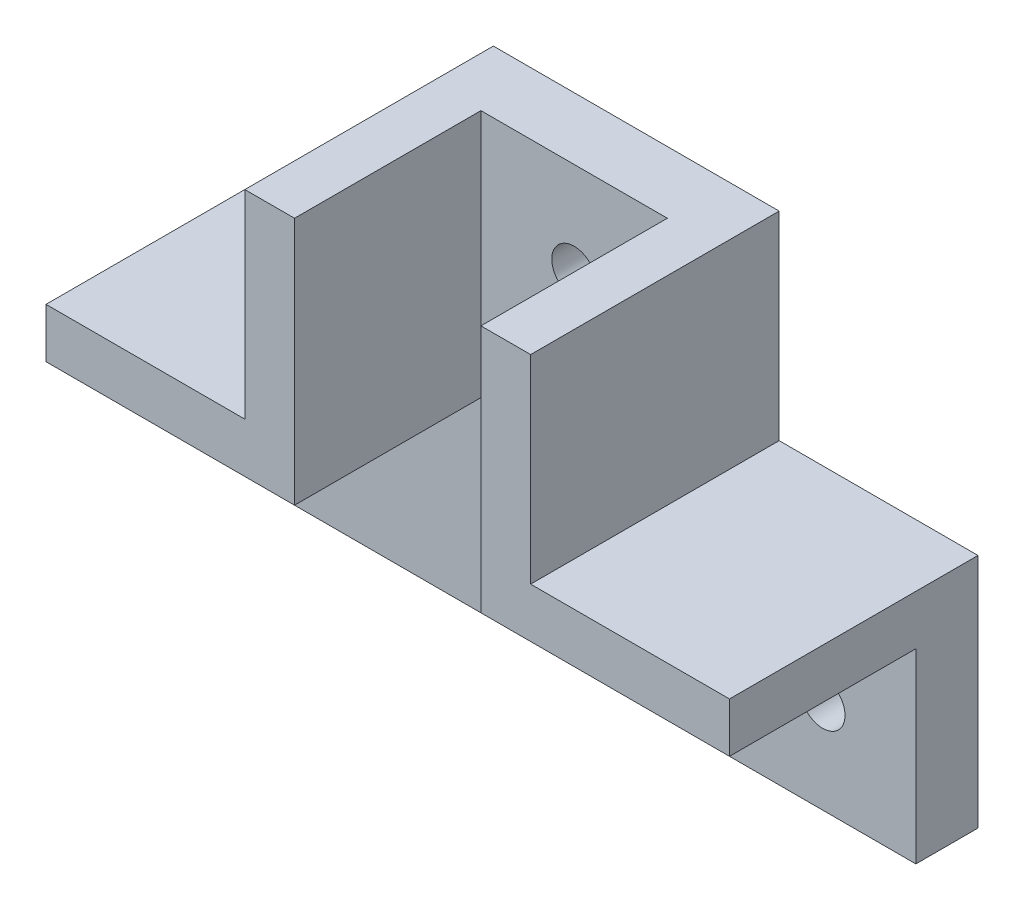
ISO-10303-21;
HEADER;
FILE_DESCRIPTION(('STEP AP214'),'2;1');
FILE_NAME('part.step','',(''),(''),'','','');
FILE_SCHEMA(('AUTOMOTIVE_DESIGN { 1 0 10303 214 1 1 1 1 }'));
ENDSEC;
DATA;
#1=APPLICATION_CONTEXT('core data for automotive mechanical design processes');
#2=APPLICATION_PROTOCOL_DEFINITION('international standard','automotive_design',2000,#1);
#3=PRODUCT_CONTEXT('',#1,'mechanical');
#4=PRODUCT('Part','Part','',(#3));
#5=PRODUCT_RELATED_PRODUCT_CATEGORY('part','',(#4));
#6=PRODUCT_DEFINITION_FORMATION('','',#4);
#7=PRODUCT_DEFINITION_CONTEXT('part definition',#1,'design');
#8=PRODUCT_DEFINITION('design','',#6,#7);
#9=PRODUCT_DEFINITION_SHAPE('','',#8);
#10=(LENGTH_UNIT() NAMED_UNIT(*) SI_UNIT(.MILLI.,.METRE.));
#11=(NAMED_UNIT(*) PLANE_ANGLE_UNIT() SI_UNIT($,.RADIAN.));
#12=(NAMED_UNIT(*) SI_UNIT($,.STERADIAN.) SOLID_ANGLE_UNIT());
#13=UNCERTAINTY_MEASURE_WITH_UNIT(LENGTH_MEASURE(1.E-05),#10,'distance_accuracy_value','');
#14=(GEOMETRIC_REPRESENTATION_CONTEXT(3) GLOBAL_UNCERTAINTY_ASSIGNED_CONTEXT((#13)) GLOBAL_UNIT_ASSIGNED_CONTEXT((#10,
#11,#12)) REPRESENTATION_CONTEXT('',''));
#15=CARTESIAN_POINT('',(0.,0.,0.));
#16=DIRECTION('',(0.,0.,1.));
#17=DIRECTION('',(1.,0.,0.));
#18=AXIS2_PLACEMENT_3D('',#15,#16,#17);
#19=CARTESIAN_POINT('',(-20.6862745098039,-4.26470588235294,5.));
#20=DIRECTION('',(1.,0.,0.));
#21=DIRECTION('',(0.,1.,0.));
#22=AXIS2_PLACEMENT_3D('',#19,#20,#21);
#23=PLANE('',#22);
#24=DIRECTION('',(0.,-1.,0.));
#25=VECTOR('',#24,1.);
#26=CARTESIAN_POINT('',(-20.6862745098039,-4.26470588235294,0.));
#27=LINE('',#26,#25);
#28=CARTESIAN_POINT('',(-20.6862745098039,-0.264705882352941,0.));
#29=VERTEX_POINT('',#28);
#30=CARTESIAN_POINT('',(-20.6862745098039,-19.2647058823529,0.));
#31=VERTEX_POINT('',#30);
#32=EDGE_CURVE('E150',#29,#31,#27,.T.);
#33=ORIENTED_EDGE('',*,*,#32,.T.);
#34=DIRECTION('',(0.,0.,-1.));
#35=VECTOR('',#34,1.);
#36=CARTESIAN_POINT('',(-20.6862745098039,-19.2647058823529,5.));
#37=LINE('',#36,#35);
#38=CARTESIAN_POINT('',(-20.6862745098039,-19.2647058823529,5.));
#39=VERTEX_POINT('',#38);
#40=EDGE_CURVE('E11',#39,#31,#37,.T.);
#41=ORIENTED_EDGE('',*,*,#40,.F.);
#42=DIRECTION('',(0.,-1.,0.));
#43=VECTOR('',#42,1.);
#44=CARTESIAN_POINT('',(-20.6862745098039,-4.26470588235294,5.));
#45=LINE('',#44,#43);
#46=CARTESIAN_POINT('',(-20.6862745098039,-4.26470588235294,5.));
#47=VERTEX_POINT('',#46);
#48=EDGE_CURVE('E139',#47,#39,#45,.T.);
#49=ORIENTED_EDGE('',*,*,#48,.F.);
#50=DIRECTION('',(0.,0.,-1.));
#51=VECTOR('',#50,1.);
#52=CARTESIAN_POINT('',(-20.6862745098039,-4.26470588235294,20.));
#53=LINE('',#52,#51);
#54=CARTESIAN_POINT('',(-20.6862745098039,-4.26470588235294,20.));
#55=VERTEX_POINT('',#54);
#56=EDGE_CURVE('E68',#55,#47,#53,.T.);
#57=ORIENTED_EDGE('',*,*,#56,.F.);
#58=DIRECTION('',(0.,1.,0.));
#59=VECTOR('',#58,1.);
#60=CARTESIAN_POINT('',(-20.6862745098039,-4.26470588235294,20.));
#61=LINE('',#60,#59);
#62=CARTESIAN_POINT('',(-20.6862745098039,-0.264705882352941,20.));
#63=VERTEX_POINT('',#62);
#64=EDGE_CURVE('E209',#55,#63,#61,.T.);
#65=ORIENTED_EDGE('',*,*,#64,.T.);
#66=DIRECTION('',(0.,0.,-1.));
#67=VECTOR('',#66,1.);
#68=CARTESIAN_POINT('',(-20.6862745098039,-0.264705882352941,20.));
#69=LINE('',#68,#67);
#70=EDGE_CURVE('E135',#63,#29,#69,.T.);
#71=ORIENTED_EDGE('',*,*,#70,.T.);
#72=EDGE_LOOP('',(#33,#41,#49,#57,#65,#71));
#73=FACE_BOUND('',#72,.T.);
#74=ADVANCED_FACE('F32',(#73),#23,.F.);
#75=CARTESIAN_POINT('',(-20.6862745098039,-19.2647058823529,5.));
#76=DIRECTION('',(0.,1.,0.));
#77=DIRECTION('',(0.,0.,1.));
#78=AXIS2_PLACEMENT_3D('',#75,#76,#77);
#79=PLANE('',#78);
#80=DIRECTION('',(1.,0.,0.));
#81=VECTOR('',#80,1.);
#82=CARTESIAN_POINT('',(-20.6862745098039,-19.2647058823529,0.));
#83=LINE('',#82,#81);
#84=CARTESIAN_POINT('',(34.3137254901961,-19.2647058823529,0.));
#85=VERTEX_POINT('',#84);
#86=EDGE_CURVE('E60',#31,#85,#83,.T.);
#87=ORIENTED_EDGE('',*,*,#86,.T.);
#88=DIRECTION('',(0.,0.,-1.));
#89=VECTOR('',#88,1.);
#90=CARTESIAN_POINT('',(34.3137254901961,-19.2647058823529,5.));
#91=LINE('',#90,#89);
#92=CARTESIAN_POINT('',(34.3137254901961,-19.2647058823529,5.));
#93=VERTEX_POINT('',#92);
#94=EDGE_CURVE('E40',#93,#85,#91,.T.);
#95=ORIENTED_EDGE('',*,*,#94,.F.);
#96=DIRECTION('',(1.,0.,0.));
#97=VECTOR('',#96,1.);
#98=CARTESIAN_POINT('',(-20.6862745098039,-19.2647058823529,5.));
#99=LINE('',#98,#97);
#100=EDGE_CURVE('E141',#39,#93,#99,.T.);
#101=ORIENTED_EDGE('',*,*,#100,.F.);
#102=ORIENTED_EDGE('',*,*,#40,.T.);
#103=EDGE_LOOP('',(#87,#95,#101,#102));
#104=FACE_BOUND('',#103,.T.);
#105=ADVANCED_FACE('F244',(#104),#79,.F.);
#106=CARTESIAN_POINT('',(34.3137254901961,-4.26470588235294,5.));
#107=DIRECTION('',(-1.,0.,0.));
#108=DIRECTION('',(0.,0.,1.));
#109=AXIS2_PLACEMENT_3D('',#106,#107,#108);
#110=PLANE('',#109);
#111=DIRECTION('',(0.,1.,0.));
#112=VECTOR('',#111,1.);
#113=CARTESIAN_POINT('',(34.3137254901961,-4.26470588235294,0.));
#114=LINE('',#113,#112);
#115=CARTESIAN_POINT('',(34.3137254901961,-0.264705882352946,0.));
#116=VERTEX_POINT('',#115);
#117=EDGE_CURVE('E154',#85,#116,#114,.T.);
#118=ORIENTED_EDGE('',*,*,#117,.T.);
#119=DIRECTION('',(0.,0.,-1.));
#120=VECTOR('',#119,1.);
#121=CARTESIAN_POINT('',(34.3137254901961,-0.264705882352946,20.));
#122=LINE('',#121,#120);
#123=CARTESIAN_POINT('',(34.3137254901961,-0.264705882352946,20.));
#124=VERTEX_POINT('',#123);
#125=EDGE_CURVE('E184',#124,#116,#122,.T.);
#126=ORIENTED_EDGE('',*,*,#125,.F.);
#127=DIRECTION('',(0.,1.,0.));
#128=VECTOR('',#127,1.);
#129=CARTESIAN_POINT('',(34.3137254901961,-4.26470588235295,20.));
#130=LINE('',#129,#128);
#131=CARTESIAN_POINT('',(34.3137254901961,-4.26470588235295,20.));
#132=VERTEX_POINT('',#131);
#133=EDGE_CURVE('E181',#132,#124,#130,.T.);
#134=ORIENTED_EDGE('',*,*,#133,.F.);
#135=DIRECTION('',(0.,0.,-1.));
#136=VECTOR('',#135,1.);
#137=CARTESIAN_POINT('',(34.3137254901961,-4.26470588235295,20.));
#138=LINE('',#137,#136);
#139=CARTESIAN_POINT('',(34.3137254901961,-4.26470588235294,5.));
#140=VERTEX_POINT('',#139);
#141=EDGE_CURVE('E207',#132,#140,#138,.T.);
#142=ORIENTED_EDGE('',*,*,#141,.T.);
#143=DIRECTION('',(0.,1.,0.));
#144=VECTOR('',#143,1.);
#145=CARTESIAN_POINT('',(34.3137254901961,-4.26470588235294,5.));
#146=LINE('',#145,#144);
#147=EDGE_CURVE('E144',#93,#140,#146,.T.);
#148=ORIENTED_EDGE('',*,*,#147,.F.);
#149=ORIENTED_EDGE('',*,*,#94,.T.);
#150=EDGE_LOOP('',(#118,#126,#134,#142,#148,#149));
#151=FACE_BOUND('',#150,.T.);
#152=ADVANCED_FACE('F161',(#151),#110,.F.);
#153=CARTESIAN_POINT('',(-0.686274509803913,15.7352941176471,5.));
#154=DIRECTION('',(0.,-1.,0.));
#155=DIRECTION('',(0.,0.,-1.));
#156=AXIS2_PLACEMENT_3D('',#153,#154,#155);
#157=PLANE('',#156);
#158=DIRECTION('',(-1.,0.,0.));
#159=VECTOR('',#158,1.);
#160=CARTESIAN_POINT('',(-0.686274509803913,15.7352941176471,0.));
#161=LINE('',#160,#159);
#162=CARTESIAN_POINT('',(18.3137254901961,15.7352941176471,0.));
#163=VERTEX_POINT('',#162);
#164=CARTESIAN_POINT('',(-4.68627450980391,15.7352941176471,0.));
#165=VERTEX_POINT('',#164);
#166=EDGE_CURVE('E142',#163,#165,#161,.T.);
#167=ORIENTED_EDGE('',*,*,#166,.T.);
#168=DIRECTION('',(0.,0.,-1.));
#169=VECTOR('',#168,1.);
#170=CARTESIAN_POINT('',(-4.68627450980391,15.7352941176471,20.));
#171=LINE('',#170,#169);
#172=CARTESIAN_POINT('',(-4.68627450980391,15.7352941176471,20.));
#173=VERTEX_POINT('',#172);
#174=EDGE_CURVE('E126',#173,#165,#171,.T.);
#175=ORIENTED_EDGE('',*,*,#174,.F.);
#176=DIRECTION('',(-1.,0.,0.));
#177=VECTOR('',#176,1.);
#178=CARTESIAN_POINT('',(-0.686274509803913,15.7352941176471,20.));
#179=LINE('',#178,#177);
#180=CARTESIAN_POINT('',(-0.686274509803913,15.7352941176471,20.));
#181=VERTEX_POINT('',#180);
#182=EDGE_CURVE('E124',#181,#173,#179,.T.);
#183=ORIENTED_EDGE('',*,*,#182,.F.);
#184=DIRECTION('',(0.,0.,-1.));
#185=VECTOR('',#184,1.);
#186=CARTESIAN_POINT('',(-0.686274509803913,15.7352941176471,20.));
#187=LINE('',#186,#185);
#188=CARTESIAN_POINT('',(-0.686274509803913,15.7352941176471,5.));
#189=VERTEX_POINT('',#188);
#190=EDGE_CURVE('E116',#181,#189,#187,.T.);
#191=ORIENTED_EDGE('',*,*,#190,.T.);
#192=DIRECTION('',(-1.,0.,0.));
#193=VECTOR('',#192,1.);
#194=CARTESIAN_POINT('',(-0.686274509803913,15.7352941176471,5.));
#195=LINE('',#194,#193);
#196=CARTESIAN_POINT('',(14.3137254901961,15.7352941176471,5.));
#197=VERTEX_POINT('',#196);
#198=EDGE_CURVE('E100',#197,#189,#195,.T.);
#199=ORIENTED_EDGE('',*,*,#198,.F.);
#200=DIRECTION('',(0.,0.,-1.));
#201=VECTOR('',#200,1.);
#202=CARTESIAN_POINT('',(14.3137254901961,15.7352941176471,20.));
#203=LINE('',#202,#201);
#204=CARTESIAN_POINT('',(14.3137254901961,15.7352941176471,20.));
#205=VERTEX_POINT('',#204);
#206=EDGE_CURVE('E202',#205,#197,#203,.T.);
#207=ORIENTED_EDGE('',*,*,#206,.F.);
#208=DIRECTION('',(1.,0.,0.));
#209=VECTOR('',#208,1.);
#210=CARTESIAN_POINT('',(14.3137254901961,15.7352941176471,20.));
#211=LINE('',#210,#209);
#212=CARTESIAN_POINT('',(18.3137254901961,15.7352941176471,20.));
#213=VERTEX_POINT('',#212);
#214=EDGE_CURVE('E263',#205,#213,#211,.T.);
#215=ORIENTED_EDGE('',*,*,#214,.T.);
#216=DIRECTION('',(0.,0.,-1.));
#217=VECTOR('',#216,1.);
#218=CARTESIAN_POINT('',(18.3137254901961,15.7352941176471,20.));
#219=LINE('',#218,#217);
#220=EDGE_CURVE('E196',#213,#163,#219,.T.);
#221=ORIENTED_EDGE('',*,*,#220,.T.);
#222=EDGE_LOOP('',(#167,#175,#183,#191,#199,#207,#215,#221));
#223=FACE_BOUND('',#222,.T.);
#224=ADVANCED_FACE('F121',(#223),#157,.F.);
#225=CARTESIAN_POINT('',(0.,0.,5.));
#226=DIRECTION('',(0.,0.,1.));
#227=DIRECTION('',(1.,0.,0.));
#228=AXIS2_PLACEMENT_3D('',#225,#226,#227);
#229=PLANE('',#228);
#230=CARTESIAN_POINT('',(6.81372549019609,8.23529411764706,5.));
#231=DIRECTION('',(0.,0.,1.));
#232=DIRECTION('',(1.,0.,0.));
#233=AXIS2_PLACEMENT_3D('',#230,#231,#232);
#234=CIRCLE('',#233,1.8);
#235=CARTESIAN_POINT('',(8.61372549019609,8.23529411764706,5.));
#236=VERTEX_POINT('',#235);
#237=EDGE_CURVE('E274',#236,#236,#234,.T.);
#238=ORIENTED_EDGE('',*,*,#237,.F.);
#239=EDGE_LOOP('',(#238));
#240=FACE_BOUND('',#239,.T.);
#241=CARTESIAN_POINT('',(-13.1862745098039,-11.7647058823529,5.));
#242=DIRECTION('',(0.,0.,1.));
#243=DIRECTION('',(1.,0.,0.));
#244=AXIS2_PLACEMENT_3D('',#241,#242,#243);
#245=CIRCLE('',#244,1.8);
#246=CARTESIAN_POINT('',(-11.3862745098039,-11.7647058823529,5.));
#247=VERTEX_POINT('',#246);
#248=EDGE_CURVE('E284',#247,#247,#245,.T.);
#249=ORIENTED_EDGE('',*,*,#248,.F.);
#250=EDGE_LOOP('',(#249));
#251=FACE_BOUND('',#250,.T.);
#252=CARTESIAN_POINT('',(26.8137254901961,-11.7647058823529,5.));
#253=DIRECTION('',(0.,0.,1.));
#254=DIRECTION('',(1.,0.,0.));
#255=AXIS2_PLACEMENT_3D('',#252,#253,#254);
#256=CIRCLE('',#255,1.8);
#257=CARTESIAN_POINT('',(28.6137254901961,-11.7647058823529,5.));
#258=VERTEX_POINT('',#257);
#259=EDGE_CURVE('E289',#258,#258,#256,.T.);
#260=ORIENTED_EDGE('',*,*,#259,.F.);
#261=EDGE_LOOP('',(#260));
#262=FACE_BOUND('',#261,.T.);
#263=ORIENTED_EDGE('',*,*,#48,.T.);
#264=ORIENTED_EDGE('',*,*,#100,.T.);
#265=ORIENTED_EDGE('',*,*,#147,.T.);
#266=DIRECTION('',(-1.,0.,0.));
#267=VECTOR('',#266,1.);
#268=CARTESIAN_POINT('',(14.3137254901961,-4.26470588235294,5.));
#269=LINE('',#268,#267);
#270=CARTESIAN_POINT('',(14.3137254901961,-4.26470588235294,5.));
#271=VERTEX_POINT('',#270);
#272=EDGE_CURVE('E146',#140,#271,#269,.T.);
#273=ORIENTED_EDGE('',*,*,#272,.T.);
#274=DIRECTION('',(0.,1.,0.));
#275=VECTOR('',#274,1.);
#276=CARTESIAN_POINT('',(14.3137254901961,15.7352941176471,5.));
#277=LINE('',#276,#275);
#278=EDGE_CURVE('E105',#271,#197,#277,.T.);
#279=ORIENTED_EDGE('',*,*,#278,.T.);
#280=ORIENTED_EDGE('',*,*,#198,.T.);
#281=DIRECTION('',(0.,-1.,0.));
#282=VECTOR('',#281,1.);
#283=CARTESIAN_POINT('',(-0.686274509803913,15.7352941176471,5.));
#284=LINE('',#283,#282);
#285=CARTESIAN_POINT('',(-0.68627450980391,-4.26470588235294,5.));
#286=VERTEX_POINT('',#285);
#287=EDGE_CURVE('E103',#189,#286,#284,.T.);
#288=ORIENTED_EDGE('',*,*,#287,.T.);
#289=DIRECTION('',(-1.,0.,0.));
#290=VECTOR('',#289,1.);
#291=CARTESIAN_POINT('',(-20.6862745098039,-4.26470588235294,5.));
#292=LINE('',#291,#290);
#293=EDGE_CURVE('E48',#286,#47,#292,.T.);
#294=ORIENTED_EDGE('',*,*,#293,.T.);
#295=EDGE_LOOP('',(#263,#264,#265,#273,#279,#280,#288,#294));
#296=FACE_BOUND('',#295,.T.);
#297=ADVANCED_FACE('F102',(#240,#251,#262,#296),#229,.T.);
#298=CARTESIAN_POINT('',(0.,0.,0.));
#299=DIRECTION('',(0.,0.,1.));
#300=DIRECTION('',(1.,0.,0.));
#301=AXIS2_PLACEMENT_3D('',#298,#299,#300);
#302=PLANE('',#301);
#303=CARTESIAN_POINT('',(6.81372549019609,8.23529411764706,0.));
#304=DIRECTION('',(0.,0.,1.));
#305=DIRECTION('',(1.,0.,0.));
#306=AXIS2_PLACEMENT_3D('',#303,#304,#305);
#307=CIRCLE('',#306,1.8);
#308=CARTESIAN_POINT('',(8.61372549019609,8.23529411764706,0.));
#309=VERTEX_POINT('',#308);
#310=EDGE_CURVE('E272',#309,#309,#307,.T.);
#311=ORIENTED_EDGE('',*,*,#310,.T.);
#312=EDGE_LOOP('',(#311));
#313=FACE_BOUND('',#312,.T.);
#314=CARTESIAN_POINT('',(-13.1862745098039,-11.7647058823529,0.));
#315=DIRECTION('',(0.,0.,1.));
#316=DIRECTION('',(1.,0.,0.));
#317=AXIS2_PLACEMENT_3D('',#314,#315,#316);
#318=CIRCLE('',#317,1.8);
#319=CARTESIAN_POINT('',(-11.3862745098039,-11.7647058823529,0.));
#320=VERTEX_POINT('',#319);
#321=EDGE_CURVE('E279',#320,#320,#318,.T.);
#322=ORIENTED_EDGE('',*,*,#321,.T.);
#323=EDGE_LOOP('',(#322));
#324=FACE_BOUND('',#323,.T.);
#325=CARTESIAN_POINT('',(26.8137254901961,-11.7647058823529,0.));
#326=DIRECTION('',(0.,0.,1.));
#327=DIRECTION('',(1.,0.,0.));
#328=AXIS2_PLACEMENT_3D('',#325,#326,#327);
#329=CIRCLE('',#328,1.8);
#330=CARTESIAN_POINT('',(28.6137254901961,-11.7647058823529,0.));
#331=VERTEX_POINT('',#330);
#332=EDGE_CURVE('E287',#331,#331,#329,.T.);
#333=ORIENTED_EDGE('',*,*,#332,.T.);
#334=EDGE_LOOP('',(#333));
#335=FACE_BOUND('',#334,.T.);
#336=ORIENTED_EDGE('',*,*,#166,.F.);
#337=DIRECTION('',(0.,-1.,0.));
#338=VECTOR('',#337,1.);
#339=CARTESIAN_POINT('',(18.3137254901961,15.7352941176471,0.));
#340=LINE('',#339,#338);
#341=CARTESIAN_POINT('',(18.3137254901961,-0.264705882352947,0.));
#342=VERTEX_POINT('',#341);
#343=EDGE_CURVE('E175',#163,#342,#340,.T.);
#344=ORIENTED_EDGE('',*,*,#343,.T.);
#345=DIRECTION('',(-1.,0.,0.));
#346=VECTOR('',#345,1.);
#347=CARTESIAN_POINT('',(34.3137254901961,-0.264705882352946,0.));
#348=LINE('',#347,#346);
#349=EDGE_CURVE('E171',#116,#342,#348,.T.);
#350=ORIENTED_EDGE('',*,*,#349,.F.);
#351=ORIENTED_EDGE('',*,*,#117,.F.);
#352=ORIENTED_EDGE('',*,*,#86,.F.);
#353=ORIENTED_EDGE('',*,*,#32,.F.);
#354=DIRECTION('',(1.,0.,0.));
#355=VECTOR('',#354,1.);
#356=CARTESIAN_POINT('',(-6.07997052750672,-0.264705882352943,0.));
#357=LINE('',#356,#355);
#358=CARTESIAN_POINT('',(-4.68627450980391,-0.264705882352945,0.));
#359=VERTEX_POINT('',#358);
#360=EDGE_CURVE('E190',#29,#359,#357,.T.);
#361=ORIENTED_EDGE('',*,*,#360,.T.);
#362=DIRECTION('',(0.,-1.,0.));
#363=VECTOR('',#362,1.);
#364=CARTESIAN_POINT('',(-4.68627450980391,15.7352941176471,0.));
#365=LINE('',#364,#363);
#366=EDGE_CURVE('E194',#165,#359,#365,.T.);
#367=ORIENTED_EDGE('',*,*,#366,.F.);
#368=EDGE_LOOP('',(#336,#344,#350,#351,#352,#353,#361,#367));
#369=FACE_BOUND('',#368,.T.);
#370=ADVANCED_FACE('F168',(#313,#324,#335,#369),#302,.F.);
#371=CARTESIAN_POINT('',(-20.6862745098039,-4.26470588235294,20.));
#372=DIRECTION('',(0.,1.,0.));
#373=DIRECTION('',(-1.,0.,0.));
#374=AXIS2_PLACEMENT_3D('',#371,#372,#373);
#375=PLANE('',#374);
#376=ORIENTED_EDGE('',*,*,#293,.F.);
#377=DIRECTION('',(0.,0.,-1.));
#378=VECTOR('',#377,1.);
#379=CARTESIAN_POINT('',(-0.686274509803916,-4.26470588235294,20.));
#380=LINE('',#379,#378);
#381=CARTESIAN_POINT('',(-0.686274509803916,-4.26470588235294,20.));
#382=VERTEX_POINT('',#381);
#383=EDGE_CURVE('E119',#382,#286,#380,.T.);
#384=ORIENTED_EDGE('',*,*,#383,.F.);
#385=DIRECTION('',(1.,0.,0.));
#386=VECTOR('',#385,1.);
#387=CARTESIAN_POINT('',(-20.6862745098039,-4.26470588235294,20.));
#388=LINE('',#387,#386);
#389=EDGE_CURVE('E138',#55,#382,#388,.T.);
#390=ORIENTED_EDGE('',*,*,#389,.F.);
#391=ORIENTED_EDGE('',*,*,#56,.T.);
#392=EDGE_LOOP('',(#376,#384,#390,#391));
#393=FACE_BOUND('',#392,.T.);
#394=ADVANCED_FACE('F223',(#393),#375,.F.);
#395=CARTESIAN_POINT('',(-0.686274509803913,15.7352941176471,20.));
#396=DIRECTION('',(1.,0.,0.));
#397=DIRECTION('',(0.,1.,0.));
#398=AXIS2_PLACEMENT_3D('',#395,#396,#397);
#399=PLANE('',#398);
#400=ORIENTED_EDGE('',*,*,#383,.T.);
#401=ORIENTED_EDGE('',*,*,#287,.F.);
#402=ORIENTED_EDGE('',*,*,#190,.F.);
#403=DIRECTION('',(0.,-1.,0.));
#404=VECTOR('',#403,1.);
#405=CARTESIAN_POINT('',(-0.686274509803913,15.7352941176471,20.));
#406=LINE('',#405,#404);
#407=EDGE_CURVE('E218',#181,#382,#406,.T.);
#408=ORIENTED_EDGE('',*,*,#407,.T.);
#409=EDGE_LOOP('',(#400,#401,#402,#408));
#410=FACE_BOUND('',#409,.T.);
#411=ADVANCED_FACE('F114',(#410),#399,.T.);
#412=CARTESIAN_POINT('',(-4.68627450980391,15.7352941176471,20.));
#413=DIRECTION('',(1.,0.,0.));
#414=DIRECTION('',(0.,1.,0.));
#415=AXIS2_PLACEMENT_3D('',#412,#413,#414);
#416=PLANE('',#415);
#417=ORIENTED_EDGE('',*,*,#366,.T.);
#418=DIRECTION('',(0.,0.,-1.));
#419=VECTOR('',#418,1.);
#420=CARTESIAN_POINT('',(-4.68627450980391,-0.264705882352945,20.));
#421=LINE('',#420,#419);
#422=CARTESIAN_POINT('',(-4.68627450980391,-0.264705882352945,20.));
#423=VERTEX_POINT('',#422);
#424=EDGE_CURVE('E130',#423,#359,#421,.T.);
#425=ORIENTED_EDGE('',*,*,#424,.F.);
#426=DIRECTION('',(0.,-1.,0.));
#427=VECTOR('',#426,1.);
#428=CARTESIAN_POINT('',(-4.68627450980391,15.7352941176471,20.));
#429=LINE('',#428,#427);
#430=EDGE_CURVE('E214',#173,#423,#429,.T.);
#431=ORIENTED_EDGE('',*,*,#430,.F.);
#432=ORIENTED_EDGE('',*,*,#174,.T.);
#433=EDGE_LOOP('',(#417,#425,#431,#432));
#434=FACE_BOUND('',#433,.T.);
#435=ADVANCED_FACE('F241',(#434),#416,.F.);
#436=CARTESIAN_POINT('',(-6.07997052750672,-0.264705882352943,20.));
#437=DIRECTION('',(0.,1.,0.));
#438=DIRECTION('',(-1.,0.,0.));
#439=AXIS2_PLACEMENT_3D('',#436,#437,#438);
#440=PLANE('',#439);
#441=ORIENTED_EDGE('',*,*,#360,.F.);
#442=ORIENTED_EDGE('',*,*,#70,.F.);
#443=DIRECTION('',(1.,0.,0.));
#444=VECTOR('',#443,1.);
#445=CARTESIAN_POINT('',(-20.6862745098039,-0.264705882352941,20.));
#446=LINE('',#445,#444);
#447=EDGE_CURVE('E211',#63,#423,#446,.T.);
#448=ORIENTED_EDGE('',*,*,#447,.T.);
#449=ORIENTED_EDGE('',*,*,#424,.T.);
#450=EDGE_LOOP('',(#441,#442,#448,#449));
#451=FACE_BOUND('',#450,.T.);
#452=ADVANCED_FACE('F242',(#451),#440,.T.);
#453=CARTESIAN_POINT('',(0.,0.,20.));
#454=DIRECTION('',(0.,0.,-1.));
#455=DIRECTION('',(-1.,0.,0.));
#456=AXIS2_PLACEMENT_3D('',#453,#454,#455);
#457=PLANE('',#456);
#458=ORIENTED_EDGE('',*,*,#64,.F.);
#459=ORIENTED_EDGE('',*,*,#389,.T.);
#460=ORIENTED_EDGE('',*,*,#407,.F.);
#461=ORIENTED_EDGE('',*,*,#182,.T.);
#462=ORIENTED_EDGE('',*,*,#430,.T.);
#463=ORIENTED_EDGE('',*,*,#447,.F.);
#464=EDGE_LOOP('',(#458,#459,#460,#461,#462,#463));
#465=FACE_BOUND('',#464,.T.);
#466=ADVANCED_FACE('F227',(#465),#457,.F.);
#467=CARTESIAN_POINT('',(34.3137254901961,-0.264705882352946,20.));
#468=DIRECTION('',(0.,-1.,0.));
#469=DIRECTION('',(1.,0.,0.));
#470=AXIS2_PLACEMENT_3D('',#467,#468,#469);
#471=PLANE('',#470);
#472=ORIENTED_EDGE('',*,*,#349,.T.);
#473=DIRECTION('',(0.,0.,-1.));
#474=VECTOR('',#473,1.);
#475=CARTESIAN_POINT('',(18.3137254901961,-0.264705882352947,20.));
#476=LINE('',#475,#474);
#477=CARTESIAN_POINT('',(18.3137254901961,-0.264705882352947,20.));
#478=VERTEX_POINT('',#477);
#479=EDGE_CURVE('E191',#478,#342,#476,.T.);
#480=ORIENTED_EDGE('',*,*,#479,.F.);
#481=DIRECTION('',(-1.,0.,0.));
#482=VECTOR('',#481,1.);
#483=CARTESIAN_POINT('',(19.7074215078989,-0.264705882352945,20.));
#484=LINE('',#483,#482);
#485=EDGE_CURVE('E187',#124,#478,#484,.T.);
#486=ORIENTED_EDGE('',*,*,#485,.F.);
#487=ORIENTED_EDGE('',*,*,#125,.T.);
#488=EDGE_LOOP('',(#472,#480,#486,#487));
#489=FACE_BOUND('',#488,.T.);
#490=ADVANCED_FACE('F185',(#489),#471,.F.);
#491=CARTESIAN_POINT('',(18.3137254901961,15.7352941176471,20.));
#492=DIRECTION('',(1.,0.,0.));
#493=DIRECTION('',(0.,1.,0.));
#494=AXIS2_PLACEMENT_3D('',#491,#492,#493);
#495=PLANE('',#494);
#496=ORIENTED_EDGE('',*,*,#343,.F.);
#497=ORIENTED_EDGE('',*,*,#220,.F.);
#498=DIRECTION('',(0.,-1.,0.));
#499=VECTOR('',#498,1.);
#500=CARTESIAN_POINT('',(18.3137254901961,15.7352941176471,20.));
#501=LINE('',#500,#499);
#502=EDGE_CURVE('E269',#213,#478,#501,.T.);
#503=ORIENTED_EDGE('',*,*,#502,.T.);
#504=ORIENTED_EDGE('',*,*,#479,.T.);
#505=EDGE_LOOP('',(#496,#497,#503,#504));
#506=FACE_BOUND('',#505,.T.);
#507=ADVANCED_FACE('F333',(#506),#495,.T.);
#508=CARTESIAN_POINT('',(14.3137254901961,15.7352941176471,20.));
#509=DIRECTION('',(1.,0.,0.));
#510=DIRECTION('',(0.,1.,0.));
#511=AXIS2_PLACEMENT_3D('',#508,#509,#510);
#512=PLANE('',#511);
#513=ORIENTED_EDGE('',*,*,#278,.F.);
#514=DIRECTION('',(0.,0.,-1.));
#515=VECTOR('',#514,1.);
#516=CARTESIAN_POINT('',(14.3137254901961,-4.26470588235295,20.));
#517=LINE('',#516,#515);
#518=CARTESIAN_POINT('',(14.3137254901961,-4.26470588235295,20.));
#519=VERTEX_POINT('',#518);
#520=EDGE_CURVE('E204',#519,#271,#517,.T.);
#521=ORIENTED_EDGE('',*,*,#520,.F.);
#522=DIRECTION('',(0.,-1.,0.));
#523=VECTOR('',#522,1.);
#524=CARTESIAN_POINT('',(14.3137254901961,15.7352941176471,20.));
#525=LINE('',#524,#523);
#526=EDGE_CURVE('E261',#205,#519,#525,.T.);
#527=ORIENTED_EDGE('',*,*,#526,.F.);
#528=ORIENTED_EDGE('',*,*,#206,.T.);
#529=EDGE_LOOP('',(#513,#521,#527,#528));
#530=FACE_BOUND('',#529,.T.);
#531=ADVANCED_FACE('F344',(#530),#512,.F.);
#532=CARTESIAN_POINT('',(34.3137254901961,-4.26470588235295,20.));
#533=DIRECTION('',(0.,-1.,0.));
#534=DIRECTION('',(1.,0.,0.));
#535=AXIS2_PLACEMENT_3D('',#532,#533,#534);
#536=PLANE('',#535);
#537=ORIENTED_EDGE('',*,*,#520,.T.);
#538=ORIENTED_EDGE('',*,*,#272,.F.);
#539=ORIENTED_EDGE('',*,*,#141,.F.);
#540=DIRECTION('',(-1.,0.,0.));
#541=VECTOR('',#540,1.);
#542=CARTESIAN_POINT('',(34.3137254901961,-4.26470588235295,20.));
#543=LINE('',#542,#541);
#544=EDGE_CURVE('E255',#132,#519,#543,.T.);
#545=ORIENTED_EDGE('',*,*,#544,.T.);
#546=EDGE_LOOP('',(#537,#538,#539,#545));
#547=FACE_BOUND('',#546,.T.);
#548=ADVANCED_FACE('F248',(#547),#536,.T.);
#549=CARTESIAN_POINT('',(13.6274509803922,0.,20.));
#550=DIRECTION('',(0.,0.,-1.));
#551=DIRECTION('',(1.,0.,0.));
#552=AXIS2_PLACEMENT_3D('',#549,#550,#551);
#553=PLANE('',#552);
#554=ORIENTED_EDGE('',*,*,#133,.T.);
#555=ORIENTED_EDGE('',*,*,#485,.T.);
#556=ORIENTED_EDGE('',*,*,#502,.F.);
#557=ORIENTED_EDGE('',*,*,#214,.F.);
#558=ORIENTED_EDGE('',*,*,#526,.T.);
#559=ORIENTED_EDGE('',*,*,#544,.F.);
#560=EDGE_LOOP('',(#554,#555,#556,#557,#558,#559));
#561=FACE_BOUND('',#560,.T.);
#562=ADVANCED_FACE('F258',(#561),#553,.F.);
#563=CARTESIAN_POINT('',(26.8137254901961,-11.7647058823529,0.));
#564=DIRECTION('',(0.,0.,1.));
#565=DIRECTION('',(1.,0.,0.));
#566=AXIS2_PLACEMENT_3D('',#563,#564,#565);
#567=CYLINDRICAL_SURFACE('',#566,1.8);
#568=ORIENTED_EDGE('',*,*,#332,.F.);
#569=EDGE_LOOP('',(#568));
#570=FACE_BOUND('',#569,.T.);
#571=ORIENTED_EDGE('',*,*,#259,.T.);
#572=EDGE_LOOP('',(#571));
#573=FACE_BOUND('',#572,.T.);
#574=ADVANCED_FACE('F293',(#570,#573),#567,.F.);
#575=CARTESIAN_POINT('',(-13.1862745098039,-11.7647058823529,0.));
#576=DIRECTION('',(0.,0.,1.));
#577=DIRECTION('',(1.,0.,0.));
#578=AXIS2_PLACEMENT_3D('',#575,#576,#577);
#579=CYLINDRICAL_SURFACE('',#578,1.8);
#580=ORIENTED_EDGE('',*,*,#321,.F.);
#581=EDGE_LOOP('',(#580));
#582=FACE_BOUND('',#581,.T.);
#583=ORIENTED_EDGE('',*,*,#248,.T.);
#584=EDGE_LOOP('',(#583));
#585=FACE_BOUND('',#584,.T.);
#586=ADVANCED_FACE('F392',(#582,#585),#579,.F.);
#587=CARTESIAN_POINT('',(6.81372549019609,8.23529411764706,0.));
#588=DIRECTION('',(0.,0.,1.));
#589=DIRECTION('',(1.,0.,0.));
#590=AXIS2_PLACEMENT_3D('',#587,#588,#589);
#591=CYLINDRICAL_SURFACE('',#590,1.8);
#592=ORIENTED_EDGE('',*,*,#310,.F.);
#593=EDGE_LOOP('',(#592));
#594=FACE_BOUND('',#593,.T.);
#595=ORIENTED_EDGE('',*,*,#237,.T.);
#596=EDGE_LOOP('',(#595));
#597=FACE_BOUND('',#596,.T.);
#598=ADVANCED_FACE('F402',(#594,#597),#591,.F.);
#599=CLOSED_SHELL('',(#74,#105,#152,#224,#297,#370,#394,#411,#435,#452,#466,#490,#507,#531,#548,
#562,#574,#586,#598));
#600=MANIFOLD_SOLID_BREP('B2',#599);
#601=ADVANCED_BREP_SHAPE_REPRESENTATION('',(#18,#600),#14);
#602=SHAPE_DEFINITION_REPRESENTATION(#9,#601);
ENDSEC;
END-ISO-10303-21;
